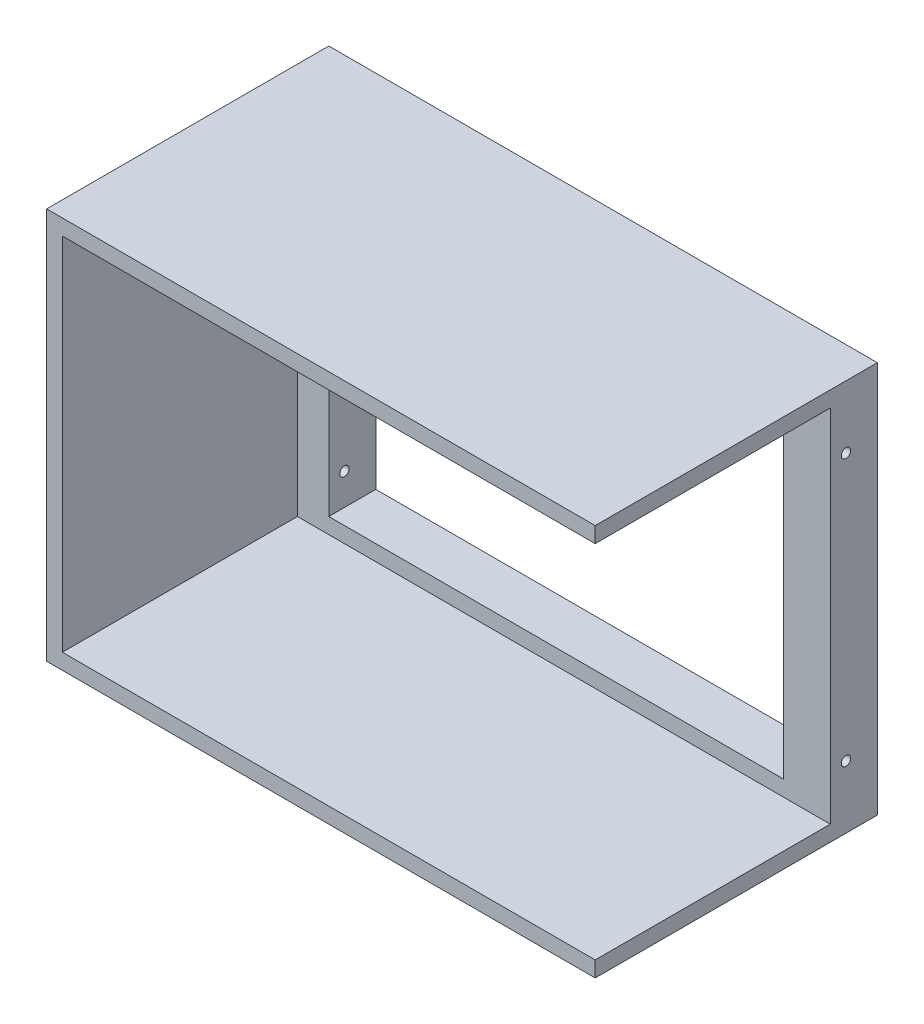
ISO-10303-21;
HEADER;
FILE_DESCRIPTION(('STEP AP214'),'2;1');
FILE_NAME('part.step','',(''),(''),'','','');
FILE_SCHEMA(('AUTOMOTIVE_DESIGN { 1 0 10303 214 1 1 1 1 }'));
ENDSEC;
DATA;
#1=APPLICATION_CONTEXT('core data for automotive mechanical design processes');
#2=APPLICATION_PROTOCOL_DEFINITION('international standard','automotive_design',2000,#1);
#3=PRODUCT_CONTEXT('',#1,'mechanical');
#4=PRODUCT('Part','Part','',(#3));
#5=PRODUCT_RELATED_PRODUCT_CATEGORY('part','',(#4));
#6=PRODUCT_DEFINITION_FORMATION('','',#4);
#7=PRODUCT_DEFINITION_CONTEXT('part definition',#1,'design');
#8=PRODUCT_DEFINITION('design','',#6,#7);
#9=PRODUCT_DEFINITION_SHAPE('','',#8);
#10=(LENGTH_UNIT() NAMED_UNIT(*) SI_UNIT(.MILLI.,.METRE.));
#11=(NAMED_UNIT(*) PLANE_ANGLE_UNIT() SI_UNIT($,.RADIAN.));
#12=(NAMED_UNIT(*) SI_UNIT($,.STERADIAN.) SOLID_ANGLE_UNIT());
#13=UNCERTAINTY_MEASURE_WITH_UNIT(LENGTH_MEASURE(1.E-05),#10,'distance_accuracy_value','');
#14=(GEOMETRIC_REPRESENTATION_CONTEXT(3) GLOBAL_UNCERTAINTY_ASSIGNED_CONTEXT((#13)) GLOBAL_UNIT_ASSIGNED_CONTEXT((#10,
#11,#12)) REPRESENTATION_CONTEXT('',''));
#15=CARTESIAN_POINT('',(0.,0.,0.));
#16=DIRECTION('',(0.,0.,1.));
#17=DIRECTION('',(1.,0.,0.));
#18=AXIS2_PLACEMENT_3D('',#15,#16,#17);
#19=CARTESIAN_POINT('',(-175.,-125.,30.));
#20=DIRECTION('',(0.,1.,0.));
#21=DIRECTION('',(0.,0.,1.));
#22=AXIS2_PLACEMENT_3D('',#19,#20,#21);
#23=PLANE('',#22);
#24=DIRECTION('',(1.,0.,0.));
#25=VECTOR('',#24,1.);
#26=CARTESIAN_POINT('',(-175.,-125.,0.));
#27=LINE('',#26,#25);
#28=CARTESIAN_POINT('',(-175.,-125.,0.));
#29=VERTEX_POINT('',#28);
#30=CARTESIAN_POINT('',(175.,-125.,0.));
#31=VERTEX_POINT('',#30);
#32=EDGE_CURVE('E207',#29,#31,#27,.T.);
#33=ORIENTED_EDGE('',*,*,#32,.T.);
#34=DIRECTION('',(0.,0.,-1.));
#35=VECTOR('',#34,1.);
#36=CARTESIAN_POINT('',(175.,-125.,30.));
#37=LINE('',#36,#35);
#38=CARTESIAN_POINT('',(175.,-125.,180.));
#39=VERTEX_POINT('',#38);
#40=EDGE_CURVE('E11',#39,#31,#37,.T.);
#41=ORIENTED_EDGE('',*,*,#40,.F.);
#42=DIRECTION('',(1.,0.,0.));
#43=VECTOR('',#42,1.);
#44=CARTESIAN_POINT('',(-175.,-125.,180.));
#45=LINE('',#44,#43);
#46=CARTESIAN_POINT('',(-175.,-125.,180.));
#47=VERTEX_POINT('',#46);
#48=EDGE_CURVE('E153',#47,#39,#45,.T.);
#49=ORIENTED_EDGE('',*,*,#48,.F.);
#50=DIRECTION('',(0.,0.,-1.));
#51=VECTOR('',#50,1.);
#52=CARTESIAN_POINT('',(-175.,-125.,30.));
#53=LINE('',#52,#51);
#54=EDGE_CURVE('E225',#47,#29,#53,.T.);
#55=ORIENTED_EDGE('',*,*,#54,.T.);
#56=EDGE_LOOP('',(#33,#41,#49,#55));
#57=FACE_BOUND('',#56,.T.);
#58=ADVANCED_FACE('F37',(#57),#23,.F.);
#59=CARTESIAN_POINT('',(175.,-125.,30.));
#60=DIRECTION('',(-1.,0.,0.));
#61=DIRECTION('',(0.,0.,1.));
#62=AXIS2_PLACEMENT_3D('',#59,#60,#61);
#63=PLANE('',#62);
#64=DIRECTION('',(0.,1.,0.));
#65=VECTOR('',#64,1.);
#66=CARTESIAN_POINT('',(175.,125.,180.));
#67=LINE('',#66,#65);
#68=CARTESIAN_POINT('',(175.,115.,180.));
#69=VERTEX_POINT('',#68);
#70=CARTESIAN_POINT('',(175.,125.,180.));
#71=VERTEX_POINT('',#70);
#72=EDGE_CURVE('E155',#69,#71,#67,.T.);
#73=ORIENTED_EDGE('',*,*,#72,.F.);
#74=DIRECTION('',(0.,0.,1.));
#75=VECTOR('',#74,1.);
#76=CARTESIAN_POINT('',(175.,115.,-200.217288664427));
#77=LINE('',#76,#75);
#78=CARTESIAN_POINT('',(175.,115.,30.));
#79=VERTEX_POINT('',#78);
#80=EDGE_CURVE('E147',#79,#69,#77,.T.);
#81=ORIENTED_EDGE('',*,*,#80,.F.);
#82=DIRECTION('',(0.,-1.,0.));
#83=VECTOR('',#82,1.);
#84=CARTESIAN_POINT('',(175.,115.,30.));
#85=LINE('',#84,#83);
#86=CARTESIAN_POINT('',(175.,-115.,30.));
#87=VERTEX_POINT('',#86);
#88=EDGE_CURVE('E146',#79,#87,#85,.T.);
#89=ORIENTED_EDGE('',*,*,#88,.T.);
#90=DIRECTION('',(0.,0.,1.));
#91=VECTOR('',#90,1.);
#92=CARTESIAN_POINT('',(175.,-115.,-200.217288664427));
#93=LINE('',#92,#91);
#94=CARTESIAN_POINT('',(175.,-115.,180.));
#95=VERTEX_POINT('',#94);
#96=EDGE_CURVE('E129',#87,#95,#93,.T.);
#97=ORIENTED_EDGE('',*,*,#96,.T.);
#98=EDGE_CURVE('E144',#39,#95,#67,.T.);
#99=ORIENTED_EDGE('',*,*,#98,.F.);
#100=ORIENTED_EDGE('',*,*,#40,.T.);
#101=DIRECTION('',(0.,1.,0.));
#102=VECTOR('',#101,1.);
#103=CARTESIAN_POINT('',(175.,-125.,0.));
#104=LINE('',#103,#102);
#105=CARTESIAN_POINT('',(175.,125.,0.));
#106=VERTEX_POINT('',#105);
#107=EDGE_CURVE('E216',#31,#106,#104,.T.);
#108=ORIENTED_EDGE('',*,*,#107,.T.);
#109=DIRECTION('',(0.,0.,-1.));
#110=VECTOR('',#109,1.);
#111=CARTESIAN_POINT('',(175.,125.,30.));
#112=LINE('',#111,#110);
#113=EDGE_CURVE('E45',#71,#106,#112,.T.);
#114=ORIENTED_EDGE('',*,*,#113,.F.);
#115=EDGE_LOOP('',(#73,#81,#89,#97,#99,#100,#108,#114));
#116=FACE_BOUND('',#115,.T.);
#117=CARTESIAN_POINT('',(175.,-85.,20.));
#118=DIRECTION('',(-1.,0.,0.));
#119=DIRECTION('',(0.,0.,-1.));
#120=AXIS2_PLACEMENT_3D('',#117,#118,#119);
#121=CIRCLE('',#120,3.);
#122=CARTESIAN_POINT('',(175.,-85.,17.));
#123=VERTEX_POINT('',#122);
#124=EDGE_CURVE('E158',#123,#123,#121,.T.);
#125=ORIENTED_EDGE('',*,*,#124,.T.);
#126=EDGE_LOOP('',(#125));
#127=FACE_BOUND('',#126,.T.);
#128=CARTESIAN_POINT('',(175.,85.,20.));
#129=DIRECTION('',(1.,0.,0.));
#130=DIRECTION('',(0.,0.,-1.));
#131=AXIS2_PLACEMENT_3D('',#128,#129,#130);
#132=CIRCLE('',#131,3.);
#133=CARTESIAN_POINT('',(175.,85.,17.));
#134=VERTEX_POINT('',#133);
#135=EDGE_CURVE('E171',#134,#134,#132,.T.);
#136=ORIENTED_EDGE('',*,*,#135,.F.);
#137=EDGE_LOOP('',(#136));
#138=FACE_BOUND('',#137,.T.);
#139=ADVANCED_FACE('F142',(#116,#127,#138),#63,.F.);
#140=CARTESIAN_POINT('',(-175.,125.,30.));
#141=DIRECTION('',(0.,1.,0.));
#142=DIRECTION('',(0.,0.,1.));
#143=AXIS2_PLACEMENT_3D('',#140,#141,#142);
#144=PLANE('',#143);
#145=DIRECTION('',(1.,0.,0.));
#146=VECTOR('',#145,1.);
#147=CARTESIAN_POINT('',(-175.,125.,0.));
#148=LINE('',#147,#146);
#149=CARTESIAN_POINT('',(-175.,125.,0.));
#150=VERTEX_POINT('',#149);
#151=EDGE_CURVE('E219',#150,#106,#148,.T.);
#152=ORIENTED_EDGE('',*,*,#151,.F.);
#153=DIRECTION('',(0.,0.,-1.));
#154=VECTOR('',#153,1.);
#155=CARTESIAN_POINT('',(-175.,125.,30.));
#156=LINE('',#155,#154);
#157=CARTESIAN_POINT('',(-175.,125.,180.));
#158=VERTEX_POINT('',#157);
#159=EDGE_CURVE('E227',#158,#150,#156,.T.);
#160=ORIENTED_EDGE('',*,*,#159,.F.);
#161=DIRECTION('',(-1.,0.,0.));
#162=VECTOR('',#161,1.);
#163=CARTESIAN_POINT('',(-175.,125.,180.));
#164=LINE('',#163,#162);
#165=EDGE_CURVE('E154',#71,#158,#164,.T.);
#166=ORIENTED_EDGE('',*,*,#165,.F.);
#167=ORIENTED_EDGE('',*,*,#113,.T.);
#168=EDGE_LOOP('',(#152,#160,#166,#167));
#169=FACE_BOUND('',#168,.T.);
#170=ADVANCED_FACE('F257',(#169),#144,.T.);
#171=CARTESIAN_POINT('',(-175.,-125.,30.));
#172=DIRECTION('',(-1.,0.,0.));
#173=DIRECTION('',(0.,0.,1.));
#174=AXIS2_PLACEMENT_3D('',#171,#172,#173);
#175=PLANE('',#174);
#176=CARTESIAN_POINT('',(-175.,-85.,20.));
#177=DIRECTION('',(-1.,0.,0.));
#178=DIRECTION('',(0.,0.,-1.));
#179=AXIS2_PLACEMENT_3D('',#176,#177,#178);
#180=CIRCLE('',#179,3.);
#181=CARTESIAN_POINT('',(-175.,-85.,17.));
#182=VERTEX_POINT('',#181);
#183=EDGE_CURVE('E163',#182,#182,#180,.T.);
#184=ORIENTED_EDGE('',*,*,#183,.F.);
#185=EDGE_LOOP('',(#184));
#186=FACE_BOUND('',#185,.T.);
#187=CARTESIAN_POINT('',(-175.,85.,20.));
#188=DIRECTION('',(1.,0.,0.));
#189=DIRECTION('',(0.,0.,-1.));
#190=AXIS2_PLACEMENT_3D('',#187,#188,#189);
#191=CIRCLE('',#190,3.);
#192=CARTESIAN_POINT('',(-175.,85.,17.));
#193=VERTEX_POINT('',#192);
#194=EDGE_CURVE('E172',#193,#193,#191,.T.);
#195=ORIENTED_EDGE('',*,*,#194,.T.);
#196=EDGE_LOOP('',(#195));
#197=FACE_BOUND('',#196,.T.);
#198=DIRECTION('',(0.,1.,0.));
#199=VECTOR('',#198,1.);
#200=CARTESIAN_POINT('',(-175.,-125.,0.));
#201=LINE('',#200,#199);
#202=EDGE_CURVE('E222',#29,#150,#201,.T.);
#203=ORIENTED_EDGE('',*,*,#202,.F.);
#204=ORIENTED_EDGE('',*,*,#54,.F.);
#205=DIRECTION('',(0.,-1.,0.));
#206=VECTOR('',#205,1.);
#207=CARTESIAN_POINT('',(-175.,125.,180.));
#208=LINE('',#207,#206);
#209=EDGE_CURVE('E266',#158,#47,#208,.T.);
#210=ORIENTED_EDGE('',*,*,#209,.F.);
#211=ORIENTED_EDGE('',*,*,#159,.T.);
#212=EDGE_LOOP('',(#203,#204,#210,#211));
#213=FACE_BOUND('',#212,.T.);
#214=ADVANCED_FACE('F263',(#186,#197,#213),#175,.T.);
#215=CARTESIAN_POINT('',(0.,0.,30.));
#216=DIRECTION('',(0.,0.,1.));
#217=DIRECTION('',(1.,0.,0.));
#218=AXIS2_PLACEMENT_3D('',#215,#216,#217);
#219=PLANE('',#218);
#220=DIRECTION('',(0.,-1.,0.));
#221=VECTOR('',#220,1.);
#222=CARTESIAN_POINT('',(-165.,115.,30.));
#223=LINE('',#222,#221);
#224=CARTESIAN_POINT('',(-165.,115.,30.));
#225=VERTEX_POINT('',#224);
#226=CARTESIAN_POINT('',(-165.,-115.,30.));
#227=VERTEX_POINT('',#226);
#228=EDGE_CURVE('E53',#225,#227,#223,.T.);
#229=ORIENTED_EDGE('',*,*,#228,.T.);
#230=DIRECTION('',(1.,0.,0.));
#231=VECTOR('',#230,1.);
#232=CARTESIAN_POINT('',(-165.,-115.,30.));
#233=LINE('',#232,#231);
#234=EDGE_CURVE('E282',#227,#87,#233,.T.);
#235=ORIENTED_EDGE('',*,*,#234,.T.);
#236=ORIENTED_EDGE('',*,*,#88,.F.);
#237=DIRECTION('',(-1.,0.,0.));
#238=VECTOR('',#237,1.);
#239=CARTESIAN_POINT('',(-165.,115.,30.));
#240=LINE('',#239,#238);
#241=EDGE_CURVE('E58',#79,#225,#240,.T.);
#242=ORIENTED_EDGE('',*,*,#241,.T.);
#243=EDGE_LOOP('',(#229,#235,#236,#242));
#244=FACE_BOUND('',#243,.T.);
#245=DIRECTION('',(0.,1.,0.));
#246=VECTOR('',#245,1.);
#247=CARTESIAN_POINT('',(145.,-105.,30.));
#248=LINE('',#247,#246);
#249=CARTESIAN_POINT('',(145.,-105.,30.));
#250=VERTEX_POINT('',#249);
#251=CARTESIAN_POINT('',(145.,105.,30.));
#252=VERTEX_POINT('',#251);
#253=EDGE_CURVE('E181',#250,#252,#248,.T.);
#254=ORIENTED_EDGE('',*,*,#253,.F.);
#255=DIRECTION('',(1.,0.,0.));
#256=VECTOR('',#255,1.);
#257=CARTESIAN_POINT('',(-145.,-105.,30.));
#258=LINE('',#257,#256);
#259=CARTESIAN_POINT('',(-145.,-105.,30.));
#260=VERTEX_POINT('',#259);
#261=EDGE_CURVE('E186',#260,#250,#258,.T.);
#262=ORIENTED_EDGE('',*,*,#261,.F.);
#263=DIRECTION('',(0.,-1.,0.));
#264=VECTOR('',#263,1.);
#265=CARTESIAN_POINT('',(-145.,-105.,30.));
#266=LINE('',#265,#264);
#267=CARTESIAN_POINT('',(-145.,105.,30.));
#268=VERTEX_POINT('',#267);
#269=EDGE_CURVE('E200',#268,#260,#266,.T.);
#270=ORIENTED_EDGE('',*,*,#269,.F.);
#271=DIRECTION('',(-1.,0.,0.));
#272=VECTOR('',#271,1.);
#273=CARTESIAN_POINT('',(-145.,105.,30.));
#274=LINE('',#273,#272);
#275=EDGE_CURVE('E197',#252,#268,#274,.T.);
#276=ORIENTED_EDGE('',*,*,#275,.F.);
#277=EDGE_LOOP('',(#254,#262,#270,#276));
#278=FACE_BOUND('',#277,.T.);
#279=ADVANCED_FACE('F323',(#244,#278),#219,.T.);
#280=CARTESIAN_POINT('',(0.,0.,0.));
#281=DIRECTION('',(0.,0.,1.));
#282=DIRECTION('',(1.,0.,0.));
#283=AXIS2_PLACEMENT_3D('',#280,#281,#282);
#284=PLANE('',#283);
#285=DIRECTION('',(1.,0.,0.));
#286=VECTOR('',#285,1.);
#287=CARTESIAN_POINT('',(-145.,-105.,0.));
#288=LINE('',#287,#286);
#289=CARTESIAN_POINT('',(-145.,-105.,0.));
#290=VERTEX_POINT('',#289);
#291=CARTESIAN_POINT('',(145.,-105.,0.));
#292=VERTEX_POINT('',#291);
#293=EDGE_CURVE('E192',#290,#292,#288,.T.);
#294=ORIENTED_EDGE('',*,*,#293,.T.);
#295=DIRECTION('',(0.,1.,0.));
#296=VECTOR('',#295,1.);
#297=CARTESIAN_POINT('',(145.,-105.,0.));
#298=LINE('',#297,#296);
#299=CARTESIAN_POINT('',(145.,105.,0.));
#300=VERTEX_POINT('',#299);
#301=EDGE_CURVE('E182',#292,#300,#298,.T.);
#302=ORIENTED_EDGE('',*,*,#301,.T.);
#303=DIRECTION('',(-1.,0.,0.));
#304=VECTOR('',#303,1.);
#305=CARTESIAN_POINT('',(-145.,105.,0.));
#306=LINE('',#305,#304);
#307=CARTESIAN_POINT('',(-145.,105.,0.));
#308=VERTEX_POINT('',#307);
#309=EDGE_CURVE('E185',#300,#308,#306,.T.);
#310=ORIENTED_EDGE('',*,*,#309,.T.);
#311=DIRECTION('',(0.,-1.,0.));
#312=VECTOR('',#311,1.);
#313=CARTESIAN_POINT('',(-145.,-105.,0.));
#314=LINE('',#313,#312);
#315=EDGE_CURVE('E189',#308,#290,#314,.T.);
#316=ORIENTED_EDGE('',*,*,#315,.T.);
#317=EDGE_LOOP('',(#294,#302,#310,#316));
#318=FACE_BOUND('',#317,.T.);
#319=ORIENTED_EDGE('',*,*,#32,.F.);
#320=ORIENTED_EDGE('',*,*,#202,.T.);
#321=ORIENTED_EDGE('',*,*,#151,.T.);
#322=ORIENTED_EDGE('',*,*,#107,.F.);
#323=EDGE_LOOP('',(#319,#320,#321,#322));
#324=FACE_BOUND('',#323,.T.);
#325=ADVANCED_FACE('F261',(#318,#324),#284,.F.);
#326=CARTESIAN_POINT('',(145.,-105.,0.));
#327=DIRECTION('',(1.,0.,0.));
#328=DIRECTION('',(0.,0.,-1.));
#329=AXIS2_PLACEMENT_3D('',#326,#327,#328);
#330=PLANE('',#329);
#331=CARTESIAN_POINT('',(145.,-85.,20.));
#332=DIRECTION('',(1.,0.,0.));
#333=DIRECTION('',(0.,0.,-1.));
#334=AXIS2_PLACEMENT_3D('',#331,#332,#333);
#335=CIRCLE('',#334,3.);
#336=CARTESIAN_POINT('',(145.,-85.,17.));
#337=VERTEX_POINT('',#336);
#338=EDGE_CURVE('E168',#337,#337,#335,.F.);
#339=ORIENTED_EDGE('',*,*,#338,.F.);
#340=EDGE_LOOP('',(#339));
#341=FACE_BOUND('',#340,.T.);
#342=CARTESIAN_POINT('',(145.,85.,20.));
#343=DIRECTION('',(1.,0.,0.));
#344=DIRECTION('',(0.,0.,-1.));
#345=AXIS2_PLACEMENT_3D('',#342,#343,#344);
#346=CIRCLE('',#345,3.);
#347=CARTESIAN_POINT('',(145.,85.,17.));
#348=VERTEX_POINT('',#347);
#349=EDGE_CURVE('E178',#348,#348,#346,.T.);
#350=ORIENTED_EDGE('',*,*,#349,.T.);
#351=EDGE_LOOP('',(#350));
#352=FACE_BOUND('',#351,.T.);
#353=ORIENTED_EDGE('',*,*,#253,.T.);
#354=DIRECTION('',(0.,0.,1.));
#355=VECTOR('',#354,1.);
#356=CARTESIAN_POINT('',(145.,105.,0.));
#357=LINE('',#356,#355);
#358=EDGE_CURVE('E195',#300,#252,#357,.T.);
#359=ORIENTED_EDGE('',*,*,#358,.F.);
#360=ORIENTED_EDGE('',*,*,#301,.F.);
#361=DIRECTION('',(0.,0.,1.));
#362=VECTOR('',#361,1.);
#363=CARTESIAN_POINT('',(145.,-105.,0.));
#364=LINE('',#363,#362);
#365=EDGE_CURVE('E205',#292,#250,#364,.T.);
#366=ORIENTED_EDGE('',*,*,#365,.T.);
#367=EDGE_LOOP('',(#353,#359,#360,#366));
#368=FACE_BOUND('',#367,.T.);
#369=ADVANCED_FACE('F308',(#341,#352,#368),#330,.F.);
#370=CARTESIAN_POINT('',(-145.,-105.,0.));
#371=DIRECTION('',(0.,-1.,0.));
#372=DIRECTION('',(0.,0.,-1.));
#373=AXIS2_PLACEMENT_3D('',#370,#371,#372);
#374=PLANE('',#373);
#375=ORIENTED_EDGE('',*,*,#261,.T.);
#376=ORIENTED_EDGE('',*,*,#365,.F.);
#377=ORIENTED_EDGE('',*,*,#293,.F.);
#378=DIRECTION('',(0.,0.,1.));
#379=VECTOR('',#378,1.);
#380=CARTESIAN_POINT('',(-145.,-105.,0.));
#381=LINE('',#380,#379);
#382=EDGE_CURVE('E208',#290,#260,#381,.T.);
#383=ORIENTED_EDGE('',*,*,#382,.T.);
#384=EDGE_LOOP('',(#375,#376,#377,#383));
#385=FACE_BOUND('',#384,.T.);
#386=ADVANCED_FACE('F311',(#385),#374,.F.);
#387=CARTESIAN_POINT('',(-145.,-105.,0.));
#388=DIRECTION('',(-1.,0.,0.));
#389=DIRECTION('',(0.,0.,1.));
#390=AXIS2_PLACEMENT_3D('',#387,#388,#389);
#391=PLANE('',#390);
#392=CARTESIAN_POINT('',(-145.,-85.,20.));
#393=DIRECTION('',(-1.,0.,0.));
#394=DIRECTION('',(0.,0.,1.));
#395=AXIS2_PLACEMENT_3D('',#392,#393,#394);
#396=CIRCLE('',#395,3.);
#397=CARTESIAN_POINT('',(-145.,-85.,23.));
#398=VERTEX_POINT('',#397);
#399=EDGE_CURVE('E40',#398,#398,#396,.F.);
#400=ORIENTED_EDGE('',*,*,#399,.F.);
#401=EDGE_LOOP('',(#400));
#402=FACE_BOUND('',#401,.T.);
#403=CARTESIAN_POINT('',(-145.,85.,20.));
#404=DIRECTION('',(-1.,0.,0.));
#405=DIRECTION('',(0.,0.,1.));
#406=AXIS2_PLACEMENT_3D('',#403,#404,#405);
#407=CIRCLE('',#406,3.);
#408=CARTESIAN_POINT('',(-145.,85.,23.));
#409=VERTEX_POINT('',#408);
#410=EDGE_CURVE('E175',#409,#409,#407,.T.);
#411=ORIENTED_EDGE('',*,*,#410,.T.);
#412=EDGE_LOOP('',(#411));
#413=FACE_BOUND('',#412,.T.);
#414=ORIENTED_EDGE('',*,*,#269,.T.);
#415=ORIENTED_EDGE('',*,*,#382,.F.);
#416=ORIENTED_EDGE('',*,*,#315,.F.);
#417=DIRECTION('',(0.,0.,1.));
#418=VECTOR('',#417,1.);
#419=CARTESIAN_POINT('',(-145.,105.,0.));
#420=LINE('',#419,#418);
#421=EDGE_CURVE('E210',#308,#268,#420,.T.);
#422=ORIENTED_EDGE('',*,*,#421,.T.);
#423=EDGE_LOOP('',(#414,#415,#416,#422));
#424=FACE_BOUND('',#423,.T.);
#425=ADVANCED_FACE('F232',(#402,#413,#424),#391,.F.);
#426=CARTESIAN_POINT('',(-145.,105.,0.));
#427=DIRECTION('',(0.,1.,0.));
#428=DIRECTION('',(0.,0.,1.));
#429=AXIS2_PLACEMENT_3D('',#426,#427,#428);
#430=PLANE('',#429);
#431=ORIENTED_EDGE('',*,*,#275,.T.);
#432=ORIENTED_EDGE('',*,*,#421,.F.);
#433=ORIENTED_EDGE('',*,*,#309,.F.);
#434=ORIENTED_EDGE('',*,*,#358,.T.);
#435=EDGE_LOOP('',(#431,#432,#433,#434));
#436=FACE_BOUND('',#435,.T.);
#437=ADVANCED_FACE('F238',(#436),#430,.F.);
#438=CARTESIAN_POINT('',(-175.,85.,20.));
#439=DIRECTION('',(1.,0.,0.));
#440=DIRECTION('',(0.,0.,-1.));
#441=AXIS2_PLACEMENT_3D('',#438,#439,#440);
#442=CYLINDRICAL_SURFACE('',#441,3.);
#443=ORIENTED_EDGE('',*,*,#194,.F.);
#444=EDGE_LOOP('',(#443));
#445=FACE_BOUND('',#444,.T.);
#446=ORIENTED_EDGE('',*,*,#410,.F.);
#447=EDGE_LOOP('',(#446));
#448=FACE_BOUND('',#447,.T.);
#449=ADVANCED_FACE('F235',(#445,#448),#442,.F.);
#450=ORIENTED_EDGE('',*,*,#135,.T.);
#451=EDGE_LOOP('',(#450));
#452=FACE_BOUND('',#451,.T.);
#453=ORIENTED_EDGE('',*,*,#349,.F.);
#454=EDGE_LOOP('',(#453));
#455=FACE_BOUND('',#454,.T.);
#456=ADVANCED_FACE('F237',(#452,#455),#442,.F.);
#457=CARTESIAN_POINT('',(-175.,-85.,20.));
#458=DIRECTION('',(1.,0.,0.));
#459=DIRECTION('',(0.,0.,-1.));
#460=AXIS2_PLACEMENT_3D('',#457,#458,#459);
#461=CYLINDRICAL_SURFACE('',#460,3.);
#462=ORIENTED_EDGE('',*,*,#183,.T.);
#463=EDGE_LOOP('',(#462));
#464=FACE_BOUND('',#463,.T.);
#465=ORIENTED_EDGE('',*,*,#399,.T.);
#466=EDGE_LOOP('',(#465));
#467=FACE_BOUND('',#466,.T.);
#468=ADVANCED_FACE('F245',(#464,#467),#461,.F.);
#469=ORIENTED_EDGE('',*,*,#124,.F.);
#470=EDGE_LOOP('',(#469));
#471=FACE_BOUND('',#470,.T.);
#472=ORIENTED_EDGE('',*,*,#338,.T.);
#473=EDGE_LOOP('',(#472));
#474=FACE_BOUND('',#473,.T.);
#475=ADVANCED_FACE('F295',(#471,#474),#461,.F.);
#476=CARTESIAN_POINT('',(0.,0.,180.));
#477=DIRECTION('',(0.,0.,1.));
#478=DIRECTION('',(1.,0.,0.));
#479=AXIS2_PLACEMENT_3D('',#476,#477,#478);
#480=PLANE('',#479);
#481=DIRECTION('',(-1.,0.,0.));
#482=VECTOR('',#481,1.);
#483=CARTESIAN_POINT('',(-165.,115.,180.));
#484=LINE('',#483,#482);
#485=CARTESIAN_POINT('',(-165.,115.,180.));
#486=VERTEX_POINT('',#485);
#487=EDGE_CURVE('E136',#69,#486,#484,.T.);
#488=ORIENTED_EDGE('',*,*,#487,.F.);
#489=ORIENTED_EDGE('',*,*,#72,.T.);
#490=ORIENTED_EDGE('',*,*,#165,.T.);
#491=ORIENTED_EDGE('',*,*,#209,.T.);
#492=ORIENTED_EDGE('',*,*,#48,.T.);
#493=ORIENTED_EDGE('',*,*,#98,.T.);
#494=DIRECTION('',(1.,0.,0.));
#495=VECTOR('',#494,1.);
#496=CARTESIAN_POINT('',(-165.,-115.,180.));
#497=LINE('',#496,#495);
#498=CARTESIAN_POINT('',(-165.,-115.,180.));
#499=VERTEX_POINT('',#498);
#500=EDGE_CURVE('E126',#499,#95,#497,.T.);
#501=ORIENTED_EDGE('',*,*,#500,.F.);
#502=DIRECTION('',(0.,-1.,0.));
#503=VECTOR('',#502,1.);
#504=CARTESIAN_POINT('',(-165.,115.,180.));
#505=LINE('',#504,#503);
#506=EDGE_CURVE('E137',#486,#499,#505,.T.);
#507=ORIENTED_EDGE('',*,*,#506,.F.);
#508=EDGE_LOOP('',(#488,#489,#490,#491,#492,#493,#501,#507));
#509=FACE_BOUND('',#508,.T.);
#510=ADVANCED_FACE('F150',(#509),#480,.T.);
#511=CARTESIAN_POINT('',(-165.,115.,180.));
#512=DIRECTION('',(1.,0.,0.));
#513=DIRECTION('',(0.,1.,0.));
#514=AXIS2_PLACEMENT_3D('',#511,#512,#513);
#515=PLANE('',#514);
#516=ORIENTED_EDGE('',*,*,#228,.F.);
#517=DIRECTION('',(0.,0.,-1.));
#518=VECTOR('',#517,1.);
#519=CARTESIAN_POINT('',(-165.,115.,180.));
#520=LINE('',#519,#518);
#521=EDGE_CURVE('E274',#486,#225,#520,.T.);
#522=ORIENTED_EDGE('',*,*,#521,.F.);
#523=ORIENTED_EDGE('',*,*,#506,.T.);
#524=DIRECTION('',(0.,0.,-1.));
#525=VECTOR('',#524,1.);
#526=CARTESIAN_POINT('',(-165.,-115.,180.));
#527=LINE('',#526,#525);
#528=EDGE_CURVE('E132',#499,#227,#527,.T.);
#529=ORIENTED_EDGE('',*,*,#528,.T.);
#530=EDGE_LOOP('',(#516,#522,#523,#529));
#531=FACE_BOUND('',#530,.T.);
#532=ADVANCED_FACE('F287',(#531),#515,.T.);
#533=CARTESIAN_POINT('',(-165.,-115.,180.));
#534=DIRECTION('',(0.,1.,0.));
#535=DIRECTION('',(0.,0.,1.));
#536=AXIS2_PLACEMENT_3D('',#533,#534,#535);
#537=PLANE('',#536);
#538=ORIENTED_EDGE('',*,*,#234,.F.);
#539=ORIENTED_EDGE('',*,*,#528,.F.);
#540=ORIENTED_EDGE('',*,*,#500,.T.);
#541=ORIENTED_EDGE('',*,*,#96,.F.);
#542=EDGE_LOOP('',(#538,#539,#540,#541));
#543=FACE_BOUND('',#542,.T.);
#544=ADVANCED_FACE('F128',(#543),#537,.T.);
#545=CARTESIAN_POINT('',(-165.,115.,180.));
#546=DIRECTION('',(0.,-1.,0.));
#547=DIRECTION('',(0.,0.,-1.));
#548=AXIS2_PLACEMENT_3D('',#545,#546,#547);
#549=PLANE('',#548);
#550=ORIENTED_EDGE('',*,*,#241,.F.);
#551=ORIENTED_EDGE('',*,*,#80,.T.);
#552=ORIENTED_EDGE('',*,*,#487,.T.);
#553=ORIENTED_EDGE('',*,*,#521,.T.);
#554=EDGE_LOOP('',(#550,#551,#552,#553));
#555=FACE_BOUND('',#554,.T.);
#556=ADVANCED_FACE('F276',(#555),#549,.T.);
#557=CLOSED_SHELL('',(#58,#139,#170,#214,#279,#325,#369,#386,#425,#437,#449,#456,#468,#475,#510,
#532,#544,#556));
#558=MANIFOLD_SOLID_BREP('B2',#557);
#559=ADVANCED_BREP_SHAPE_REPRESENTATION('',(#18,#558),#14);
#560=SHAPE_DEFINITION_REPRESENTATION(#9,#559);
ENDSEC;
END-ISO-10303-21;
